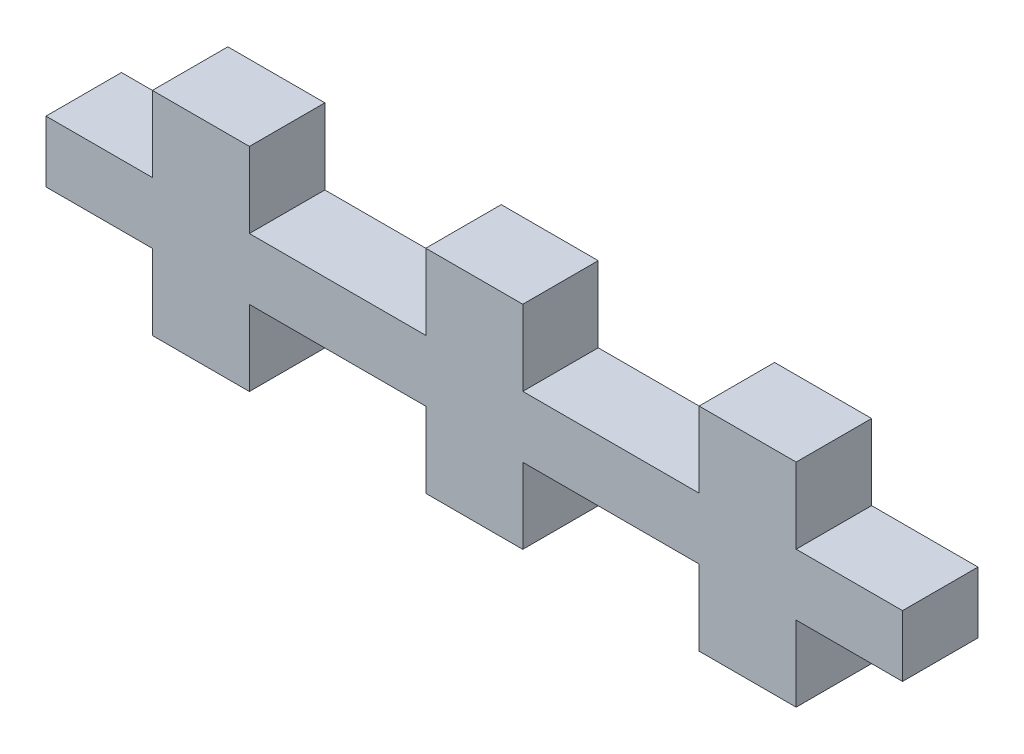
ISO-10303-21;
HEADER;
FILE_DESCRIPTION(('STEP AP214'),'2;1');
FILE_NAME('part.step','',(''),(''),'','','');
FILE_SCHEMA(('AUTOMOTIVE_DESIGN { 1 0 10303 214 1 1 1 1 }'));
ENDSEC;
DATA;
#1=APPLICATION_CONTEXT('core data for automotive mechanical design processes');
#2=APPLICATION_PROTOCOL_DEFINITION('international standard','automotive_design',2000,#1);
#3=PRODUCT_CONTEXT('',#1,'mechanical');
#4=PRODUCT('Part','Part','',(#3));
#5=PRODUCT_RELATED_PRODUCT_CATEGORY('part','',(#4));
#6=PRODUCT_DEFINITION_FORMATION('','',#4);
#7=PRODUCT_DEFINITION_CONTEXT('part definition',#1,'design');
#8=PRODUCT_DEFINITION('design','',#6,#7);
#9=PRODUCT_DEFINITION_SHAPE('','',#8);
#10=(LENGTH_UNIT() NAMED_UNIT(*) SI_UNIT(.MILLI.,.METRE.));
#11=(NAMED_UNIT(*) PLANE_ANGLE_UNIT() SI_UNIT($,.RADIAN.));
#12=(NAMED_UNIT(*) SI_UNIT($,.STERADIAN.) SOLID_ANGLE_UNIT());
#13=UNCERTAINTY_MEASURE_WITH_UNIT(LENGTH_MEASURE(1.E-05),#10,'distance_accuracy_value','');
#14=(GEOMETRIC_REPRESENTATION_CONTEXT(3) GLOBAL_UNCERTAINTY_ASSIGNED_CONTEXT((#13)) GLOBAL_UNIT_ASSIGNED_CONTEXT((#10,
#11,#12)) REPRESENTATION_CONTEXT('',''));
#15=CARTESIAN_POINT('',(0.,0.,0.));
#16=DIRECTION('',(0.,0.,1.));
#17=DIRECTION('',(1.,0.,0.));
#18=AXIS2_PLACEMENT_3D('',#15,#16,#17);
#19=CARTESIAN_POINT('',(-13.54064,5.71563999999998,0.));
#20=DIRECTION('',(-1.,0.,0.));
#21=DIRECTION('',(0.,0.,1.));
#22=AXIS2_PLACEMENT_3D('',#19,#20,#21);
#23=PLANE('',#22);
#24=DIRECTION('',(0.,-1.,0.));
#25=VECTOR('',#24,1.);
#26=CARTESIAN_POINT('',(-13.54064,5.71563999999998,3.175));
#27=LINE('',#26,#25);
#28=CARTESIAN_POINT('',(-13.54064,5.71563999999998,3.175));
#29=VERTEX_POINT('',#28);
#30=CARTESIAN_POINT('',(-13.54064,2.54064,3.175));
#31=VERTEX_POINT('',#30);
#32=EDGE_CURVE('E268',#29,#31,#27,.T.);
#33=ORIENTED_EDGE('',*,*,#32,.F.);
#34=DIRECTION('',(0.,0.,1.));
#35=VECTOR('',#34,1.);
#36=CARTESIAN_POINT('',(-13.54064,5.71563999999998,0.));
#37=LINE('',#36,#35);
#38=CARTESIAN_POINT('',(-13.54064,5.71563999999998,0.));
#39=VERTEX_POINT('',#38);
#40=EDGE_CURVE('E11',#39,#29,#37,.T.);
#41=ORIENTED_EDGE('',*,*,#40,.F.);
#42=DIRECTION('',(0.,-1.,0.));
#43=VECTOR('',#42,1.);
#44=CARTESIAN_POINT('',(-13.54064,5.71563999999998,0.));
#45=LINE('',#44,#43);
#46=CARTESIAN_POINT('',(-13.54064,2.54064,0.));
#47=VERTEX_POINT('',#46);
#48=EDGE_CURVE('E376',#39,#47,#45,.T.);
#49=ORIENTED_EDGE('',*,*,#48,.T.);
#50=DIRECTION('',(0.,0.,1.));
#51=VECTOR('',#50,1.);
#52=CARTESIAN_POINT('',(-13.54064,2.54064,0.));
#53=LINE('',#52,#51);
#54=EDGE_CURVE('E49',#47,#31,#53,.T.);
#55=ORIENTED_EDGE('',*,*,#54,.T.);
#56=EDGE_LOOP('',(#33,#41,#49,#55));
#57=FACE_BOUND('',#56,.T.);
#58=ADVANCED_FACE('F45',(#57),#23,.T.);
#59=CARTESIAN_POINT('',(-9.45935999999999,5.71563999999998,0.));
#60=DIRECTION('',(0.,1.,0.));
#61=DIRECTION('',(-1.,0.,0.));
#62=AXIS2_PLACEMENT_3D('',#59,#60,#61);
#63=PLANE('',#62);
#64=DIRECTION('',(-1.,0.,0.));
#65=VECTOR('',#64,1.);
#66=CARTESIAN_POINT('',(-9.45935999999999,5.71563999999998,3.175));
#67=LINE('',#66,#65);
#68=CARTESIAN_POINT('',(-9.45935999999999,5.71563999999998,3.175));
#69=VERTEX_POINT('',#68);
#70=EDGE_CURVE('E373',#69,#29,#67,.T.);
#71=ORIENTED_EDGE('',*,*,#70,.F.);
#72=DIRECTION('',(0.,0.,1.));
#73=VECTOR('',#72,1.);
#74=CARTESIAN_POINT('',(-9.45935999999999,5.71563999999998,0.));
#75=LINE('',#74,#73);
#76=CARTESIAN_POINT('',(-9.45935999999999,5.71563999999998,0.));
#77=VERTEX_POINT('',#76);
#78=EDGE_CURVE('E56',#77,#69,#75,.T.);
#79=ORIENTED_EDGE('',*,*,#78,.F.);
#80=DIRECTION('',(-1.,0.,0.));
#81=VECTOR('',#80,1.);
#82=CARTESIAN_POINT('',(-9.45935999999999,5.71563999999998,0.));
#83=LINE('',#82,#81);
#84=EDGE_CURVE('E254',#77,#39,#83,.T.);
#85=ORIENTED_EDGE('',*,*,#84,.T.);
#86=ORIENTED_EDGE('',*,*,#40,.T.);
#87=EDGE_LOOP('',(#71,#79,#85,#86));
#88=FACE_BOUND('',#87,.T.);
#89=ADVANCED_FACE('F454',(#88),#63,.T.);
#90=CARTESIAN_POINT('',(-9.45935999999999,2.54064,0.));
#91=DIRECTION('',(1.,0.,0.));
#92=DIRECTION('',(0.,0.,-1.));
#93=AXIS2_PLACEMENT_3D('',#90,#91,#92);
#94=PLANE('',#93);
#95=DIRECTION('',(0.,1.,0.));
#96=VECTOR('',#95,1.);
#97=CARTESIAN_POINT('',(-9.45935999999999,2.54064,3.175));
#98=LINE('',#97,#96);
#99=CARTESIAN_POINT('',(-9.45935999999999,2.54064,3.175));
#100=VERTEX_POINT('',#99);
#101=EDGE_CURVE('E241',#100,#69,#98,.T.);
#102=ORIENTED_EDGE('',*,*,#101,.F.);
#103=DIRECTION('',(0.,0.,1.));
#104=VECTOR('',#103,1.);
#105=CARTESIAN_POINT('',(-9.45935999999999,2.54064,0.));
#106=LINE('',#105,#104);
#107=CARTESIAN_POINT('',(-9.45935999999999,2.54064,0.));
#108=VERTEX_POINT('',#107);
#109=EDGE_CURVE('E236',#108,#100,#106,.T.);
#110=ORIENTED_EDGE('',*,*,#109,.F.);
#111=DIRECTION('',(0.,1.,0.));
#112=VECTOR('',#111,1.);
#113=CARTESIAN_POINT('',(-9.45935999999999,2.54064,0.));
#114=LINE('',#113,#112);
#115=EDGE_CURVE('E239',#108,#77,#114,.T.);
#116=ORIENTED_EDGE('',*,*,#115,.T.);
#117=ORIENTED_EDGE('',*,*,#78,.T.);
#118=EDGE_LOOP('',(#102,#110,#116,#117));
#119=FACE_BOUND('',#118,.T.);
#120=ADVANCED_FACE('F238',(#119),#94,.T.);
#121=CARTESIAN_POINT('',(-2.04064000000001,2.54064,0.));
#122=DIRECTION('',(0.,1.,0.));
#123=DIRECTION('',(-1.,0.,0.));
#124=AXIS2_PLACEMENT_3D('',#121,#122,#123);
#125=PLANE('',#124);
#126=DIRECTION('',(-1.,0.,0.));
#127=VECTOR('',#126,1.);
#128=CARTESIAN_POINT('',(-2.04064000000001,2.54064,3.175));
#129=LINE('',#128,#127);
#130=CARTESIAN_POINT('',(-2.04064000000001,2.54064,3.175));
#131=VERTEX_POINT('',#130);
#132=EDGE_CURVE('E368',#131,#100,#129,.T.);
#133=ORIENTED_EDGE('',*,*,#132,.F.);
#134=DIRECTION('',(0.,0.,1.));
#135=VECTOR('',#134,1.);
#136=CARTESIAN_POINT('',(-2.04064000000001,2.54064,0.));
#137=LINE('',#136,#135);
#138=CARTESIAN_POINT('',(-2.04064000000001,2.54064,0.));
#139=VERTEX_POINT('',#138);
#140=EDGE_CURVE('E247',#139,#131,#137,.T.);
#141=ORIENTED_EDGE('',*,*,#140,.F.);
#142=DIRECTION('',(-1.,0.,0.));
#143=VECTOR('',#142,1.);
#144=CARTESIAN_POINT('',(-2.04064000000001,2.54064,0.));
#145=LINE('',#144,#143);
#146=EDGE_CURVE('E252',#139,#108,#145,.T.);
#147=ORIENTED_EDGE('',*,*,#146,.T.);
#148=ORIENTED_EDGE('',*,*,#109,.T.);
#149=EDGE_LOOP('',(#133,#141,#147,#148));
#150=FACE_BOUND('',#149,.T.);
#151=ADVANCED_FACE('F257',(#150),#125,.T.);
#152=CARTESIAN_POINT('',(-2.04064000000001,5.71563999999999,0.));
#153=DIRECTION('',(-1.,0.,0.));
#154=DIRECTION('',(0.,-1.,0.));
#155=AXIS2_PLACEMENT_3D('',#152,#153,#154);
#156=PLANE('',#155);
#157=DIRECTION('',(0.,-1.,0.));
#158=VECTOR('',#157,1.);
#159=CARTESIAN_POINT('',(-2.04064000000001,5.71563999999999,3.175));
#160=LINE('',#159,#158);
#161=CARTESIAN_POINT('',(-2.04064000000001,5.71563999999999,3.175));
#162=VERTEX_POINT('',#161);
#163=EDGE_CURVE('E364',#162,#131,#160,.T.);
#164=ORIENTED_EDGE('',*,*,#163,.F.);
#165=DIRECTION('',(0.,0.,1.));
#166=VECTOR('',#165,1.);
#167=CARTESIAN_POINT('',(-2.04064000000001,5.71563999999999,0.));
#168=LINE('',#167,#166);
#169=CARTESIAN_POINT('',(-2.04064000000001,5.71563999999999,0.));
#170=VERTEX_POINT('',#169);
#171=EDGE_CURVE('E382',#170,#162,#168,.T.);
#172=ORIENTED_EDGE('',*,*,#171,.F.);
#173=DIRECTION('',(0.,-1.,0.));
#174=VECTOR('',#173,1.);
#175=CARTESIAN_POINT('',(-2.04064000000001,5.71563999999999,0.));
#176=LINE('',#175,#174);
#177=EDGE_CURVE('E259',#170,#139,#176,.T.);
#178=ORIENTED_EDGE('',*,*,#177,.T.);
#179=ORIENTED_EDGE('',*,*,#140,.T.);
#180=EDGE_LOOP('',(#164,#172,#178,#179));
#181=FACE_BOUND('',#180,.T.);
#182=ADVANCED_FACE('F466',(#181),#156,.T.);
#183=CARTESIAN_POINT('',(2.04064000000001,5.71563999999999,0.));
#184=DIRECTION('',(0.,1.,0.));
#185=DIRECTION('',(0.,0.,1.));
#186=AXIS2_PLACEMENT_3D('',#183,#184,#185);
#187=PLANE('',#186);
#188=DIRECTION('',(-1.,0.,0.));
#189=VECTOR('',#188,1.);
#190=CARTESIAN_POINT('',(2.04064000000001,5.71563999999999,3.175));
#191=LINE('',#190,#189);
#192=CARTESIAN_POINT('',(2.04064000000001,5.71563999999999,3.175));
#193=VERTEX_POINT('',#192);
#194=EDGE_CURVE('E360',#193,#162,#191,.T.);
#195=ORIENTED_EDGE('',*,*,#194,.F.);
#196=DIRECTION('',(0.,0.,1.));
#197=VECTOR('',#196,1.);
#198=CARTESIAN_POINT('',(2.04064000000001,5.71563999999999,0.));
#199=LINE('',#198,#197);
#200=CARTESIAN_POINT('',(2.04064000000001,5.71563999999999,0.));
#201=VERTEX_POINT('',#200);
#202=EDGE_CURVE('E385',#201,#193,#199,.T.);
#203=ORIENTED_EDGE('',*,*,#202,.F.);
#204=DIRECTION('',(-1.,0.,0.));
#205=VECTOR('',#204,1.);
#206=CARTESIAN_POINT('',(2.04064000000001,5.71563999999999,0.));
#207=LINE('',#206,#205);
#208=EDGE_CURVE('E262',#201,#170,#207,.T.);
#209=ORIENTED_EDGE('',*,*,#208,.T.);
#210=ORIENTED_EDGE('',*,*,#171,.T.);
#211=EDGE_LOOP('',(#195,#203,#209,#210));
#212=FACE_BOUND('',#211,.T.);
#213=ADVANCED_FACE('F469',(#212),#187,.T.);
#214=CARTESIAN_POINT('',(2.04064000000001,2.54064,0.));
#215=DIRECTION('',(1.,0.,0.));
#216=DIRECTION('',(0.,1.,0.));
#217=AXIS2_PLACEMENT_3D('',#214,#215,#216);
#218=PLANE('',#217);
#219=DIRECTION('',(0.,1.,0.));
#220=VECTOR('',#219,1.);
#221=CARTESIAN_POINT('',(2.04064000000001,2.54064,3.175));
#222=LINE('',#221,#220);
#223=CARTESIAN_POINT('',(2.04064000000001,2.54064,3.175));
#224=VERTEX_POINT('',#223);
#225=EDGE_CURVE('E356',#224,#193,#222,.T.);
#226=ORIENTED_EDGE('',*,*,#225,.F.);
#227=DIRECTION('',(0.,0.,1.));
#228=VECTOR('',#227,1.);
#229=CARTESIAN_POINT('',(2.04064000000001,2.54064,0.));
#230=LINE('',#229,#228);
#231=CARTESIAN_POINT('',(2.04064000000001,2.54064,0.));
#232=VERTEX_POINT('',#231);
#233=EDGE_CURVE('E388',#232,#224,#230,.T.);
#234=ORIENTED_EDGE('',*,*,#233,.F.);
#235=DIRECTION('',(0.,1.,0.));
#236=VECTOR('',#235,1.);
#237=CARTESIAN_POINT('',(2.04064000000001,2.54064,0.));
#238=LINE('',#237,#236);
#239=EDGE_CURVE('E861',#232,#201,#238,.T.);
#240=ORIENTED_EDGE('',*,*,#239,.T.);
#241=ORIENTED_EDGE('',*,*,#202,.T.);
#242=EDGE_LOOP('',(#226,#234,#240,#241));
#243=FACE_BOUND('',#242,.T.);
#244=ADVANCED_FACE('F473',(#243),#218,.T.);
#245=CARTESIAN_POINT('',(9.45936000000006,2.54064,0.));
#246=DIRECTION('',(0.,1.,0.));
#247=DIRECTION('',(-1.,0.,0.));
#248=AXIS2_PLACEMENT_3D('',#245,#246,#247);
#249=PLANE('',#248);
#250=DIRECTION('',(-1.,0.,0.));
#251=VECTOR('',#250,1.);
#252=CARTESIAN_POINT('',(9.45936000000006,2.54064,3.175));
#253=LINE('',#252,#251);
#254=CARTESIAN_POINT('',(9.45936000000006,2.54064,3.175));
#255=VERTEX_POINT('',#254);
#256=EDGE_CURVE('E352',#255,#224,#253,.T.);
#257=ORIENTED_EDGE('',*,*,#256,.F.);
#258=DIRECTION('',(0.,0.,1.));
#259=VECTOR('',#258,1.);
#260=CARTESIAN_POINT('',(9.45936000000006,2.54064,0.));
#261=LINE('',#260,#259);
#262=CARTESIAN_POINT('',(9.45936000000006,2.54064,0.));
#263=VERTEX_POINT('',#262);
#264=EDGE_CURVE('E391',#263,#255,#261,.T.);
#265=ORIENTED_EDGE('',*,*,#264,.F.);
#266=DIRECTION('',(-1.,0.,0.));
#267=VECTOR('',#266,1.);
#268=CARTESIAN_POINT('',(9.45936000000006,2.54064,0.));
#269=LINE('',#268,#267);
#270=EDGE_CURVE('E857',#263,#232,#269,.T.);
#271=ORIENTED_EDGE('',*,*,#270,.T.);
#272=ORIENTED_EDGE('',*,*,#233,.T.);
#273=EDGE_LOOP('',(#257,#265,#271,#272));
#274=FACE_BOUND('',#273,.T.);
#275=ADVANCED_FACE('F477',(#274),#249,.T.);
#276=CARTESIAN_POINT('',(9.45936000000006,5.71563999999997,0.));
#277=DIRECTION('',(-1.,0.,0.));
#278=DIRECTION('',(0.,0.,1.));
#279=AXIS2_PLACEMENT_3D('',#276,#277,#278);
#280=PLANE('',#279);
#281=DIRECTION('',(0.,-1.,0.));
#282=VECTOR('',#281,1.);
#283=CARTESIAN_POINT('',(9.45936000000006,5.71563999999997,3.175));
#284=LINE('',#283,#282);
#285=CARTESIAN_POINT('',(9.45936000000006,5.71563999999997,3.175));
#286=VERTEX_POINT('',#285);
#287=EDGE_CURVE('E348',#286,#255,#284,.T.);
#288=ORIENTED_EDGE('',*,*,#287,.F.);
#289=DIRECTION('',(0.,0.,1.));
#290=VECTOR('',#289,1.);
#291=CARTESIAN_POINT('',(9.45936000000006,5.71563999999997,0.));
#292=LINE('',#291,#290);
#293=CARTESIAN_POINT('',(9.45936000000006,5.71563999999997,0.));
#294=VERTEX_POINT('',#293);
#295=EDGE_CURVE('E394',#294,#286,#292,.T.);
#296=ORIENTED_EDGE('',*,*,#295,.F.);
#297=DIRECTION('',(0.,-1.,0.));
#298=VECTOR('',#297,1.);
#299=CARTESIAN_POINT('',(9.45936000000006,5.71563999999997,0.));
#300=LINE('',#299,#298);
#301=EDGE_CURVE('E871',#294,#263,#300,.T.);
#302=ORIENTED_EDGE('',*,*,#301,.T.);
#303=ORIENTED_EDGE('',*,*,#264,.T.);
#304=EDGE_LOOP('',(#288,#296,#302,#303));
#305=FACE_BOUND('',#304,.T.);
#306=ADVANCED_FACE('F481',(#305),#280,.T.);
#307=CARTESIAN_POINT('',(13.5406400000001,5.71563999999997,0.));
#308=DIRECTION('',(0.,1.,0.));
#309=DIRECTION('',(-1.,0.,0.));
#310=AXIS2_PLACEMENT_3D('',#307,#308,#309);
#311=PLANE('',#310);
#312=DIRECTION('',(-1.,0.,0.));
#313=VECTOR('',#312,1.);
#314=CARTESIAN_POINT('',(13.5406400000001,5.71563999999997,3.175));
#315=LINE('',#314,#313);
#316=CARTESIAN_POINT('',(13.5406400000001,5.71563999999997,3.175));
#317=VERTEX_POINT('',#316);
#318=EDGE_CURVE('E344',#317,#286,#315,.T.);
#319=ORIENTED_EDGE('',*,*,#318,.F.);
#320=DIRECTION('',(0.,0.,1.));
#321=VECTOR('',#320,1.);
#322=CARTESIAN_POINT('',(13.5406400000001,5.71563999999997,0.));
#323=LINE('',#322,#321);
#324=CARTESIAN_POINT('',(13.5406400000001,5.71563999999997,0.));
#325=VERTEX_POINT('',#324);
#326=EDGE_CURVE('E397',#325,#317,#323,.T.);
#327=ORIENTED_EDGE('',*,*,#326,.F.);
#328=DIRECTION('',(-1.,0.,0.));
#329=VECTOR('',#328,1.);
#330=CARTESIAN_POINT('',(13.5406400000001,5.71563999999997,0.));
#331=LINE('',#330,#329);
#332=EDGE_CURVE('E850',#325,#294,#331,.T.);
#333=ORIENTED_EDGE('',*,*,#332,.T.);
#334=ORIENTED_EDGE('',*,*,#295,.T.);
#335=EDGE_LOOP('',(#319,#327,#333,#334));
#336=FACE_BOUND('',#335,.T.);
#337=ADVANCED_FACE('F485',(#336),#311,.T.);
#338=CARTESIAN_POINT('',(13.5406400000001,2.54064000000001,0.));
#339=DIRECTION('',(1.,0.,0.));
#340=DIRECTION('',(0.,0.,-1.));
#341=AXIS2_PLACEMENT_3D('',#338,#339,#340);
#342=PLANE('',#341);
#343=DIRECTION('',(0.,1.,0.));
#344=VECTOR('',#343,1.);
#345=CARTESIAN_POINT('',(13.5406400000001,2.54064000000001,3.175));
#346=LINE('',#345,#344);
#347=CARTESIAN_POINT('',(13.5406400000001,2.54064000000001,3.175));
#348=VERTEX_POINT('',#347);
#349=EDGE_CURVE('E340',#348,#317,#346,.T.);
#350=ORIENTED_EDGE('',*,*,#349,.F.);
#351=DIRECTION('',(0.,0.,1.));
#352=VECTOR('',#351,1.);
#353=CARTESIAN_POINT('',(13.5406400000001,2.54064000000001,0.));
#354=LINE('',#353,#352);
#355=CARTESIAN_POINT('',(13.5406400000001,2.54064000000001,0.));
#356=VERTEX_POINT('',#355);
#357=EDGE_CURVE('E400',#356,#348,#354,.T.);
#358=ORIENTED_EDGE('',*,*,#357,.F.);
#359=DIRECTION('',(0.,1.,0.));
#360=VECTOR('',#359,1.);
#361=CARTESIAN_POINT('',(13.5406400000001,2.54064000000001,0.));
#362=LINE('',#361,#360);
#363=EDGE_CURVE('E846',#356,#325,#362,.T.);
#364=ORIENTED_EDGE('',*,*,#363,.T.);
#365=ORIENTED_EDGE('',*,*,#326,.T.);
#366=EDGE_LOOP('',(#350,#358,#364,#365));
#367=FACE_BOUND('',#366,.T.);
#368=ADVANCED_FACE('F489',(#367),#342,.T.);
#369=CARTESIAN_POINT('',(18.01564,2.54064,0.));
#370=DIRECTION('',(0.,1.,0.));
#371=DIRECTION('',(-1.,0.,0.));
#372=AXIS2_PLACEMENT_3D('',#369,#370,#371);
#373=PLANE('',#372);
#374=DIRECTION('',(-1.,0.,0.));
#375=VECTOR('',#374,1.);
#376=CARTESIAN_POINT('',(18.01564,2.54064,3.175));
#377=LINE('',#376,#375);
#378=CARTESIAN_POINT('',(18.01564,2.54064,3.175));
#379=VERTEX_POINT('',#378);
#380=EDGE_CURVE('E336',#379,#348,#377,.T.);
#381=ORIENTED_EDGE('',*,*,#380,.F.);
#382=DIRECTION('',(0.,0.,1.));
#383=VECTOR('',#382,1.);
#384=CARTESIAN_POINT('',(18.01564,2.54064,0.));
#385=LINE('',#384,#383);
#386=CARTESIAN_POINT('',(18.01564,2.54064,0.));
#387=VERTEX_POINT('',#386);
#388=EDGE_CURVE('E403',#387,#379,#385,.T.);
#389=ORIENTED_EDGE('',*,*,#388,.F.);
#390=DIRECTION('',(-1.,0.,0.));
#391=VECTOR('',#390,1.);
#392=CARTESIAN_POINT('',(18.01564,2.54064,0.));
#393=LINE('',#392,#391);
#394=EDGE_CURVE('E878',#387,#356,#393,.T.);
#395=ORIENTED_EDGE('',*,*,#394,.T.);
#396=ORIENTED_EDGE('',*,*,#357,.T.);
#397=EDGE_LOOP('',(#381,#389,#395,#396));
#398=FACE_BOUND('',#397,.T.);
#399=ADVANCED_FACE('F493',(#398),#373,.T.);
#400=CARTESIAN_POINT('',(18.01564,-0.04064,0.));
#401=DIRECTION('',(1.,0.,0.));
#402=DIRECTION('',(0.,0.,-1.));
#403=AXIS2_PLACEMENT_3D('',#400,#401,#402);
#404=PLANE('',#403);
#405=DIRECTION('',(0.,1.,0.));
#406=VECTOR('',#405,1.);
#407=CARTESIAN_POINT('',(18.01564,-0.04064,3.175));
#408=LINE('',#407,#406);
#409=CARTESIAN_POINT('',(18.01564,-0.04064,3.175));
#410=VERTEX_POINT('',#409);
#411=EDGE_CURVE('E332',#410,#379,#408,.T.);
#412=ORIENTED_EDGE('',*,*,#411,.F.);
#413=DIRECTION('',(0.,0.,1.));
#414=VECTOR('',#413,1.);
#415=CARTESIAN_POINT('',(18.01564,-0.04064,0.));
#416=LINE('',#415,#414);
#417=CARTESIAN_POINT('',(18.01564,-0.04064,0.));
#418=VERTEX_POINT('',#417);
#419=EDGE_CURVE('E406',#418,#410,#416,.T.);
#420=ORIENTED_EDGE('',*,*,#419,.F.);
#421=DIRECTION('',(0.,1.,0.));
#422=VECTOR('',#421,1.);
#423=CARTESIAN_POINT('',(18.01564,-0.04064,0.));
#424=LINE('',#423,#422);
#425=EDGE_CURVE('E839',#418,#387,#424,.T.);
#426=ORIENTED_EDGE('',*,*,#425,.T.);
#427=ORIENTED_EDGE('',*,*,#388,.T.);
#428=EDGE_LOOP('',(#412,#420,#426,#427));
#429=FACE_BOUND('',#428,.T.);
#430=ADVANCED_FACE('F497',(#429),#404,.T.);
#431=CARTESIAN_POINT('',(13.5406400000001,-0.04064,0.));
#432=DIRECTION('',(0.,-1.,0.));
#433=DIRECTION('',(0.,0.,-1.));
#434=AXIS2_PLACEMENT_3D('',#431,#432,#433);
#435=PLANE('',#434);
#436=DIRECTION('',(1.,0.,0.));
#437=VECTOR('',#436,1.);
#438=CARTESIAN_POINT('',(13.5406400000001,-0.04064,3.175));
#439=LINE('',#438,#437);
#440=CARTESIAN_POINT('',(13.5406400000001,-0.04064,3.175));
#441=VERTEX_POINT('',#440);
#442=EDGE_CURVE('E328',#441,#410,#439,.T.);
#443=ORIENTED_EDGE('',*,*,#442,.F.);
#444=DIRECTION('',(0.,0.,1.));
#445=VECTOR('',#444,1.);
#446=CARTESIAN_POINT('',(13.5406400000001,-0.04064,0.));
#447=LINE('',#446,#445);
#448=CARTESIAN_POINT('',(13.5406400000001,-0.04064,0.));
#449=VERTEX_POINT('',#448);
#450=EDGE_CURVE('E409',#449,#441,#447,.T.);
#451=ORIENTED_EDGE('',*,*,#450,.F.);
#452=DIRECTION('',(1.,0.,0.));
#453=VECTOR('',#452,1.);
#454=CARTESIAN_POINT('',(13.5406400000001,-0.04064,0.));
#455=LINE('',#454,#453);
#456=EDGE_CURVE('E835',#449,#418,#455,.T.);
#457=ORIENTED_EDGE('',*,*,#456,.T.);
#458=ORIENTED_EDGE('',*,*,#419,.T.);
#459=EDGE_LOOP('',(#443,#451,#457,#458));
#460=FACE_BOUND('',#459,.T.);
#461=ADVANCED_FACE('F501',(#460),#435,.T.);
#462=CARTESIAN_POINT('',(13.5406400000001,-3.21563999999999,0.));
#463=DIRECTION('',(1.,0.,0.));
#464=DIRECTION('',(0.,0.,-1.));
#465=AXIS2_PLACEMENT_3D('',#462,#463,#464);
#466=PLANE('',#465);
#467=DIRECTION('',(0.,1.,0.));
#468=VECTOR('',#467,1.);
#469=CARTESIAN_POINT('',(13.5406400000001,-3.21563999999999,3.175));
#470=LINE('',#469,#468);
#471=CARTESIAN_POINT('',(13.5406400000001,-3.21563999999999,3.175));
#472=VERTEX_POINT('',#471);
#473=EDGE_CURVE('E324',#472,#441,#470,.T.);
#474=ORIENTED_EDGE('',*,*,#473,.F.);
#475=DIRECTION('',(0.,0.,1.));
#476=VECTOR('',#475,1.);
#477=CARTESIAN_POINT('',(13.5406400000001,-3.21563999999999,0.));
#478=LINE('',#477,#476);
#479=CARTESIAN_POINT('',(13.5406400000001,-3.21563999999999,0.));
#480=VERTEX_POINT('',#479);
#481=EDGE_CURVE('E412',#480,#472,#478,.T.);
#482=ORIENTED_EDGE('',*,*,#481,.F.);
#483=DIRECTION('',(0.,1.,0.));
#484=VECTOR('',#483,1.);
#485=CARTESIAN_POINT('',(13.5406400000001,-3.21563999999999,0.));
#486=LINE('',#485,#484);
#487=EDGE_CURVE('E885',#480,#449,#486,.T.);
#488=ORIENTED_EDGE('',*,*,#487,.T.);
#489=ORIENTED_EDGE('',*,*,#450,.T.);
#490=EDGE_LOOP('',(#474,#482,#488,#489));
#491=FACE_BOUND('',#490,.T.);
#492=ADVANCED_FACE('F505',(#491),#466,.T.);
#493=CARTESIAN_POINT('',(9.45936000000006,-3.21563999999999,0.));
#494=DIRECTION('',(0.,-1.,0.));
#495=DIRECTION('',(1.,0.,0.));
#496=AXIS2_PLACEMENT_3D('',#493,#494,#495);
#497=PLANE('',#496);
#498=DIRECTION('',(1.,0.,0.));
#499=VECTOR('',#498,1.);
#500=CARTESIAN_POINT('',(9.45936000000006,-3.21563999999999,3.175));
#501=LINE('',#500,#499);
#502=CARTESIAN_POINT('',(9.45936000000006,-3.21563999999999,3.175));
#503=VERTEX_POINT('',#502);
#504=EDGE_CURVE('E320',#503,#472,#501,.T.);
#505=ORIENTED_EDGE('',*,*,#504,.F.);
#506=DIRECTION('',(0.,0.,1.));
#507=VECTOR('',#506,1.);
#508=CARTESIAN_POINT('',(9.45936000000006,-3.21563999999999,0.));
#509=LINE('',#508,#507);
#510=CARTESIAN_POINT('',(9.45936000000006,-3.21563999999999,0.));
#511=VERTEX_POINT('',#510);
#512=EDGE_CURVE('E415',#511,#503,#509,.T.);
#513=ORIENTED_EDGE('',*,*,#512,.F.);
#514=DIRECTION('',(1.,0.,0.));
#515=VECTOR('',#514,1.);
#516=CARTESIAN_POINT('',(9.45936000000006,-3.21563999999999,0.));
#517=LINE('',#516,#515);
#518=EDGE_CURVE('E828',#511,#480,#517,.T.);
#519=ORIENTED_EDGE('',*,*,#518,.T.);
#520=ORIENTED_EDGE('',*,*,#481,.T.);
#521=EDGE_LOOP('',(#505,#513,#519,#520));
#522=FACE_BOUND('',#521,.T.);
#523=ADVANCED_FACE('F509',(#522),#497,.T.);
#524=CARTESIAN_POINT('',(9.45936000000006,-0.04064,0.));
#525=DIRECTION('',(-1.,0.,0.));
#526=DIRECTION('',(0.,0.,1.));
#527=AXIS2_PLACEMENT_3D('',#524,#525,#526);
#528=PLANE('',#527);
#529=DIRECTION('',(0.,-1.,0.));
#530=VECTOR('',#529,1.);
#531=CARTESIAN_POINT('',(9.45936000000006,-0.04064,3.175));
#532=LINE('',#531,#530);
#533=CARTESIAN_POINT('',(9.45936000000006,-0.04064,3.175));
#534=VERTEX_POINT('',#533);
#535=EDGE_CURVE('E316',#534,#503,#532,.T.);
#536=ORIENTED_EDGE('',*,*,#535,.F.);
#537=DIRECTION('',(0.,0.,1.));
#538=VECTOR('',#537,1.);
#539=CARTESIAN_POINT('',(9.45936000000006,-0.04064,0.));
#540=LINE('',#539,#538);
#541=CARTESIAN_POINT('',(9.45936000000006,-0.04064,0.));
#542=VERTEX_POINT('',#541);
#543=EDGE_CURVE('E418',#542,#534,#540,.T.);
#544=ORIENTED_EDGE('',*,*,#543,.F.);
#545=DIRECTION('',(0.,-1.,0.));
#546=VECTOR('',#545,1.);
#547=CARTESIAN_POINT('',(9.45936000000006,-0.04064,0.));
#548=LINE('',#547,#546);
#549=EDGE_CURVE('E824',#542,#511,#548,.T.);
#550=ORIENTED_EDGE('',*,*,#549,.T.);
#551=ORIENTED_EDGE('',*,*,#512,.T.);
#552=EDGE_LOOP('',(#536,#544,#550,#551));
#553=FACE_BOUND('',#552,.T.);
#554=ADVANCED_FACE('F513',(#553),#528,.T.);
#555=CARTESIAN_POINT('',(2.04064000000001,-0.04064,0.));
#556=DIRECTION('',(0.,-1.,0.));
#557=DIRECTION('',(0.,0.,-1.));
#558=AXIS2_PLACEMENT_3D('',#555,#556,#557);
#559=PLANE('',#558);
#560=DIRECTION('',(1.,0.,0.));
#561=VECTOR('',#560,1.);
#562=CARTESIAN_POINT('',(2.04064000000001,-0.04064,3.175));
#563=LINE('',#562,#561);
#564=CARTESIAN_POINT('',(2.04064000000001,-0.04064,3.175));
#565=VERTEX_POINT('',#564);
#566=EDGE_CURVE('E312',#565,#534,#563,.T.);
#567=ORIENTED_EDGE('',*,*,#566,.F.);
#568=DIRECTION('',(0.,0.,1.));
#569=VECTOR('',#568,1.);
#570=CARTESIAN_POINT('',(2.04064000000001,-0.04064,0.));
#571=LINE('',#570,#569);
#572=CARTESIAN_POINT('',(2.04064000000001,-0.04064,0.));
#573=VERTEX_POINT('',#572);
#574=EDGE_CURVE('E421',#573,#565,#571,.T.);
#575=ORIENTED_EDGE('',*,*,#574,.F.);
#576=DIRECTION('',(1.,0.,0.));
#577=VECTOR('',#576,1.);
#578=CARTESIAN_POINT('',(2.04064000000001,-0.04064,0.));
#579=LINE('',#578,#577);
#580=EDGE_CURVE('E892',#573,#542,#579,.T.);
#581=ORIENTED_EDGE('',*,*,#580,.T.);
#582=ORIENTED_EDGE('',*,*,#543,.T.);
#583=EDGE_LOOP('',(#567,#575,#581,#582));
#584=FACE_BOUND('',#583,.T.);
#585=ADVANCED_FACE('F517',(#584),#559,.T.);
#586=CARTESIAN_POINT('',(2.04064,-3.21563999999999,0.));
#587=DIRECTION('',(1.,0.,0.));
#588=DIRECTION('',(0.,1.,0.));
#589=AXIS2_PLACEMENT_3D('',#586,#587,#588);
#590=PLANE('',#589);
#591=DIRECTION('',(0.,1.,0.));
#592=VECTOR('',#591,1.);
#593=CARTESIAN_POINT('',(2.04064,-3.21563999999999,3.175));
#594=LINE('',#593,#592);
#595=CARTESIAN_POINT('',(2.04064,-3.21563999999999,3.175));
#596=VERTEX_POINT('',#595);
#597=EDGE_CURVE('E308',#596,#565,#594,.T.);
#598=ORIENTED_EDGE('',*,*,#597,.F.);
#599=DIRECTION('',(0.,0.,1.));
#600=VECTOR('',#599,1.);
#601=CARTESIAN_POINT('',(2.04064,-3.21563999999999,0.));
#602=LINE('',#601,#600);
#603=CARTESIAN_POINT('',(2.04064,-3.21563999999999,0.));
#604=VERTEX_POINT('',#603);
#605=EDGE_CURVE('E424',#604,#596,#602,.T.);
#606=ORIENTED_EDGE('',*,*,#605,.F.);
#607=DIRECTION('',(0.,1.,0.));
#608=VECTOR('',#607,1.);
#609=CARTESIAN_POINT('',(2.04064,-3.21563999999999,0.));
#610=LINE('',#609,#608);
#611=EDGE_CURVE('E817',#604,#573,#610,.T.);
#612=ORIENTED_EDGE('',*,*,#611,.T.);
#613=ORIENTED_EDGE('',*,*,#574,.T.);
#614=EDGE_LOOP('',(#598,#606,#612,#613));
#615=FACE_BOUND('',#614,.T.);
#616=ADVANCED_FACE('F521',(#615),#590,.T.);
#617=CARTESIAN_POINT('',(-2.04063999999999,-3.21564,0.));
#618=DIRECTION('',(0.,-1.,0.));
#619=DIRECTION('',(1.,0.,0.));
#620=AXIS2_PLACEMENT_3D('',#617,#618,#619);
#621=PLANE('',#620);
#622=DIRECTION('',(1.,0.,0.));
#623=VECTOR('',#622,1.);
#624=CARTESIAN_POINT('',(-2.04063999999999,-3.21564,3.175));
#625=LINE('',#624,#623);
#626=CARTESIAN_POINT('',(-2.04063999999999,-3.21564,3.175));
#627=VERTEX_POINT('',#626);
#628=EDGE_CURVE('E304',#627,#596,#625,.T.);
#629=ORIENTED_EDGE('',*,*,#628,.F.);
#630=DIRECTION('',(0.,0.,1.));
#631=VECTOR('',#630,1.);
#632=CARTESIAN_POINT('',(-2.04063999999999,-3.21564,0.));
#633=LINE('',#632,#631);
#634=CARTESIAN_POINT('',(-2.04063999999999,-3.21564,0.));
#635=VERTEX_POINT('',#634);
#636=EDGE_CURVE('E427',#635,#627,#633,.T.);
#637=ORIENTED_EDGE('',*,*,#636,.F.);
#638=DIRECTION('',(1.,0.,0.));
#639=VECTOR('',#638,1.);
#640=CARTESIAN_POINT('',(-2.04063999999999,-3.21564,0.));
#641=LINE('',#640,#639);
#642=EDGE_CURVE('E813',#635,#604,#641,.T.);
#643=ORIENTED_EDGE('',*,*,#642,.T.);
#644=ORIENTED_EDGE('',*,*,#605,.T.);
#645=EDGE_LOOP('',(#629,#637,#643,#644));
#646=FACE_BOUND('',#645,.T.);
#647=ADVANCED_FACE('F525',(#646),#621,.T.);
#648=CARTESIAN_POINT('',(-2.04064,-0.04064,0.));
#649=DIRECTION('',(-1.,0.,0.));
#650=DIRECTION('',(0.,-1.,0.));
#651=AXIS2_PLACEMENT_3D('',#648,#649,#650);
#652=PLANE('',#651);
#653=DIRECTION('',(0.,-1.,0.));
#654=VECTOR('',#653,1.);
#655=CARTESIAN_POINT('',(-2.04064,-0.04064,3.175));
#656=LINE('',#655,#654);
#657=CARTESIAN_POINT('',(-2.04064,-0.04064,3.175));
#658=VERTEX_POINT('',#657);
#659=EDGE_CURVE('E300',#658,#627,#656,.T.);
#660=ORIENTED_EDGE('',*,*,#659,.F.);
#661=DIRECTION('',(0.,0.,1.));
#662=VECTOR('',#661,1.);
#663=CARTESIAN_POINT('',(-2.04064,-0.04064,0.));
#664=LINE('',#663,#662);
#665=CARTESIAN_POINT('',(-2.04064,-0.04064,0.));
#666=VERTEX_POINT('',#665);
#667=EDGE_CURVE('E430',#666,#658,#664,.T.);
#668=ORIENTED_EDGE('',*,*,#667,.F.);
#669=DIRECTION('',(0.,-1.,0.));
#670=VECTOR('',#669,1.);
#671=CARTESIAN_POINT('',(-2.04064,-0.04064,0.));
#672=LINE('',#671,#670);
#673=EDGE_CURVE('E899',#666,#635,#672,.T.);
#674=ORIENTED_EDGE('',*,*,#673,.T.);
#675=ORIENTED_EDGE('',*,*,#636,.T.);
#676=EDGE_LOOP('',(#660,#668,#674,#675));
#677=FACE_BOUND('',#676,.T.);
#678=ADVANCED_FACE('F529',(#677),#652,.T.);
#679=CARTESIAN_POINT('',(-9.45936,-0.04064,0.));
#680=DIRECTION('',(0.,-1.,0.));
#681=DIRECTION('',(0.,0.,-1.));
#682=AXIS2_PLACEMENT_3D('',#679,#680,#681);
#683=PLANE('',#682);
#684=DIRECTION('',(1.,0.,0.));
#685=VECTOR('',#684,1.);
#686=CARTESIAN_POINT('',(-9.45936,-0.04064,3.175));
#687=LINE('',#686,#685);
#688=CARTESIAN_POINT('',(-9.45936,-0.04064,3.175));
#689=VERTEX_POINT('',#688);
#690=EDGE_CURVE('E296',#689,#658,#687,.T.);
#691=ORIENTED_EDGE('',*,*,#690,.F.);
#692=DIRECTION('',(0.,0.,1.));
#693=VECTOR('',#692,1.);
#694=CARTESIAN_POINT('',(-9.45936,-0.04064,0.));
#695=LINE('',#694,#693);
#696=CARTESIAN_POINT('',(-9.45936,-0.04064,0.));
#697=VERTEX_POINT('',#696);
#698=EDGE_CURVE('E433',#697,#689,#695,.T.);
#699=ORIENTED_EDGE('',*,*,#698,.F.);
#700=DIRECTION('',(1.,0.,0.));
#701=VECTOR('',#700,1.);
#702=CARTESIAN_POINT('',(-9.45936,-0.04064,0.));
#703=LINE('',#702,#701);
#704=EDGE_CURVE('E806',#697,#666,#703,.T.);
#705=ORIENTED_EDGE('',*,*,#704,.T.);
#706=ORIENTED_EDGE('',*,*,#667,.T.);
#707=EDGE_LOOP('',(#691,#699,#705,#706));
#708=FACE_BOUND('',#707,.T.);
#709=ADVANCED_FACE('F533',(#708),#683,.T.);
#710=CARTESIAN_POINT('',(-9.45936,-3.21563999999999,0.));
#711=DIRECTION('',(1.,0.,0.));
#712=DIRECTION('',(0.,0.,-1.));
#713=AXIS2_PLACEMENT_3D('',#710,#711,#712);
#714=PLANE('',#713);
#715=DIRECTION('',(0.,1.,0.));
#716=VECTOR('',#715,1.);
#717=CARTESIAN_POINT('',(-9.45936,-3.21563999999999,3.175));
#718=LINE('',#717,#716);
#719=CARTESIAN_POINT('',(-9.45936,-3.21563999999999,3.175));
#720=VERTEX_POINT('',#719);
#721=EDGE_CURVE('E292',#720,#689,#718,.T.);
#722=ORIENTED_EDGE('',*,*,#721,.F.);
#723=DIRECTION('',(0.,0.,1.));
#724=VECTOR('',#723,1.);
#725=CARTESIAN_POINT('',(-9.45936,-3.21563999999999,0.));
#726=LINE('',#725,#724);
#727=CARTESIAN_POINT('',(-9.45936,-3.21563999999999,0.));
#728=VERTEX_POINT('',#727);
#729=EDGE_CURVE('E436',#728,#720,#726,.T.);
#730=ORIENTED_EDGE('',*,*,#729,.F.);
#731=DIRECTION('',(0.,1.,0.));
#732=VECTOR('',#731,1.);
#733=CARTESIAN_POINT('',(-9.45936,-3.21563999999999,0.));
#734=LINE('',#733,#732);
#735=EDGE_CURVE('E802',#728,#697,#734,.T.);
#736=ORIENTED_EDGE('',*,*,#735,.T.);
#737=ORIENTED_EDGE('',*,*,#698,.T.);
#738=EDGE_LOOP('',(#722,#730,#736,#737));
#739=FACE_BOUND('',#738,.T.);
#740=ADVANCED_FACE('F537',(#739),#714,.T.);
#741=CARTESIAN_POINT('',(-13.54064,-3.21563999999999,0.));
#742=DIRECTION('',(0.,-1.,0.));
#743=DIRECTION('',(1.,0.,0.));
#744=AXIS2_PLACEMENT_3D('',#741,#742,#743);
#745=PLANE('',#744);
#746=DIRECTION('',(1.,0.,0.));
#747=VECTOR('',#746,1.);
#748=CARTESIAN_POINT('',(-13.54064,-3.21563999999999,3.175));
#749=LINE('',#748,#747);
#750=CARTESIAN_POINT('',(-13.54064,-3.21563999999999,3.175));
#751=VERTEX_POINT('',#750);
#752=EDGE_CURVE('E288',#751,#720,#749,.T.);
#753=ORIENTED_EDGE('',*,*,#752,.F.);
#754=DIRECTION('',(0.,0.,1.));
#755=VECTOR('',#754,1.);
#756=CARTESIAN_POINT('',(-13.54064,-3.21563999999999,0.));
#757=LINE('',#756,#755);
#758=CARTESIAN_POINT('',(-13.54064,-3.21563999999999,0.));
#759=VERTEX_POINT('',#758);
#760=EDGE_CURVE('E439',#759,#751,#757,.T.);
#761=ORIENTED_EDGE('',*,*,#760,.F.);
#762=DIRECTION('',(1.,0.,0.));
#763=VECTOR('',#762,1.);
#764=CARTESIAN_POINT('',(-13.54064,-3.21563999999999,0.));
#765=LINE('',#764,#763);
#766=EDGE_CURVE('E906',#759,#728,#765,.T.);
#767=ORIENTED_EDGE('',*,*,#766,.T.);
#768=ORIENTED_EDGE('',*,*,#729,.T.);
#769=EDGE_LOOP('',(#753,#761,#767,#768));
#770=FACE_BOUND('',#769,.T.);
#771=ADVANCED_FACE('F541',(#770),#745,.T.);
#772=CARTESIAN_POINT('',(-13.54064,-0.04064,0.));
#773=DIRECTION('',(-1.,0.,0.));
#774=DIRECTION('',(0.,0.,1.));
#775=AXIS2_PLACEMENT_3D('',#772,#773,#774);
#776=PLANE('',#775);
#777=DIRECTION('',(0.,-1.,0.));
#778=VECTOR('',#777,1.);
#779=CARTESIAN_POINT('',(-13.54064,-0.04064,3.175));
#780=LINE('',#779,#778);
#781=CARTESIAN_POINT('',(-13.54064,-0.04064,3.175));
#782=VERTEX_POINT('',#781);
#783=EDGE_CURVE('E284',#782,#751,#780,.T.);
#784=ORIENTED_EDGE('',*,*,#783,.F.);
#785=DIRECTION('',(0.,0.,1.));
#786=VECTOR('',#785,1.);
#787=CARTESIAN_POINT('',(-13.54064,-0.04064,0.));
#788=LINE('',#787,#786);
#789=CARTESIAN_POINT('',(-13.54064,-0.04064,0.));
#790=VERTEX_POINT('',#789);
#791=EDGE_CURVE('E442',#790,#782,#788,.T.);
#792=ORIENTED_EDGE('',*,*,#791,.F.);
#793=DIRECTION('',(0.,-1.,0.));
#794=VECTOR('',#793,1.);
#795=CARTESIAN_POINT('',(-13.54064,-0.04064,0.));
#796=LINE('',#795,#794);
#797=EDGE_CURVE('E795',#790,#759,#796,.T.);
#798=ORIENTED_EDGE('',*,*,#797,.T.);
#799=ORIENTED_EDGE('',*,*,#760,.T.);
#800=EDGE_LOOP('',(#784,#792,#798,#799));
#801=FACE_BOUND('',#800,.T.);
#802=ADVANCED_FACE('F545',(#801),#776,.T.);
#803=CARTESIAN_POINT('',(-18.01564,-0.04064,0.));
#804=DIRECTION('',(0.,-1.,0.));
#805=DIRECTION('',(0.,0.,-1.));
#806=AXIS2_PLACEMENT_3D('',#803,#804,#805);
#807=PLANE('',#806);
#808=DIRECTION('',(1.,0.,0.));
#809=VECTOR('',#808,1.);
#810=CARTESIAN_POINT('',(-18.01564,-0.04064,3.175));
#811=LINE('',#810,#809);
#812=CARTESIAN_POINT('',(-18.01564,-0.04064,3.175));
#813=VERTEX_POINT('',#812);
#814=EDGE_CURVE('E280',#813,#782,#811,.T.);
#815=ORIENTED_EDGE('',*,*,#814,.F.);
#816=DIRECTION('',(0.,0.,1.));
#817=VECTOR('',#816,1.);
#818=CARTESIAN_POINT('',(-18.01564,-0.04064,0.));
#819=LINE('',#818,#817);
#820=CARTESIAN_POINT('',(-18.01564,-0.04064,0.));
#821=VERTEX_POINT('',#820);
#822=EDGE_CURVE('E445',#821,#813,#819,.T.);
#823=ORIENTED_EDGE('',*,*,#822,.F.);
#824=DIRECTION('',(1.,0.,0.));
#825=VECTOR('',#824,1.);
#826=CARTESIAN_POINT('',(-18.01564,-0.04064,0.));
#827=LINE('',#826,#825);
#828=EDGE_CURVE('E791',#821,#790,#827,.T.);
#829=ORIENTED_EDGE('',*,*,#828,.T.);
#830=ORIENTED_EDGE('',*,*,#791,.T.);
#831=EDGE_LOOP('',(#815,#823,#829,#830));
#832=FACE_BOUND('',#831,.T.);
#833=ADVANCED_FACE('F549',(#832),#807,.T.);
#834=CARTESIAN_POINT('',(-18.01564,2.54064,0.));
#835=DIRECTION('',(-1.,0.,0.));
#836=DIRECTION('',(0.,0.,1.));
#837=AXIS2_PLACEMENT_3D('',#834,#835,#836);
#838=PLANE('',#837);
#839=DIRECTION('',(0.,-1.,0.));
#840=VECTOR('',#839,1.);
#841=CARTESIAN_POINT('',(-18.01564,2.54064,3.175));
#842=LINE('',#841,#840);
#843=CARTESIAN_POINT('',(-18.01564,2.54064,3.175));
#844=VERTEX_POINT('',#843);
#845=EDGE_CURVE('E276',#844,#813,#842,.T.);
#846=ORIENTED_EDGE('',*,*,#845,.F.);
#847=DIRECTION('',(0.,0.,1.));
#848=VECTOR('',#847,1.);
#849=CARTESIAN_POINT('',(-18.01564,2.54064,0.));
#850=LINE('',#849,#848);
#851=CARTESIAN_POINT('',(-18.01564,2.54064,0.));
#852=VERTEX_POINT('',#851);
#853=EDGE_CURVE('E447',#852,#844,#850,.T.);
#854=ORIENTED_EDGE('',*,*,#853,.F.);
#855=DIRECTION('',(0.,-1.,0.));
#856=VECTOR('',#855,1.);
#857=CARTESIAN_POINT('',(-18.01564,2.54064,0.));
#858=LINE('',#857,#856);
#859=EDGE_CURVE('E913',#852,#821,#858,.T.);
#860=ORIENTED_EDGE('',*,*,#859,.T.);
#861=ORIENTED_EDGE('',*,*,#822,.T.);
#862=EDGE_LOOP('',(#846,#854,#860,#861));
#863=FACE_BOUND('',#862,.T.);
#864=ADVANCED_FACE('F553',(#863),#838,.T.);
#865=CARTESIAN_POINT('',(-13.54064,2.54064,0.));
#866=DIRECTION('',(0.,1.,0.));
#867=DIRECTION('',(-1.,0.,0.));
#868=AXIS2_PLACEMENT_3D('',#865,#866,#867);
#869=PLANE('',#868);
#870=DIRECTION('',(-1.,0.,0.));
#871=VECTOR('',#870,1.);
#872=CARTESIAN_POINT('',(-13.54064,2.54064,3.175));
#873=LINE('',#872,#871);
#874=EDGE_CURVE('E272',#31,#844,#873,.T.);
#875=ORIENTED_EDGE('',*,*,#874,.F.);
#876=ORIENTED_EDGE('',*,*,#54,.F.);
#877=DIRECTION('',(-1.,0.,0.));
#878=VECTOR('',#877,1.);
#879=CARTESIAN_POINT('',(-13.54064,2.54064,0.));
#880=LINE('',#879,#878);
#881=EDGE_CURVE('E916',#47,#852,#880,.T.);
#882=ORIENTED_EDGE('',*,*,#881,.T.);
#883=ORIENTED_EDGE('',*,*,#853,.T.);
#884=EDGE_LOOP('',(#875,#876,#882,#883));
#885=FACE_BOUND('',#884,.T.);
#886=ADVANCED_FACE('F451',(#885),#869,.T.);
#887=CARTESIAN_POINT('',(0.,0.,3.175));
#888=DIRECTION('',(0.,0.,1.));
#889=DIRECTION('',(1.,0.,0.));
#890=AXIS2_PLACEMENT_3D('',#887,#888,#889);
#891=PLANE('',#890);
#892=ORIENTED_EDGE('',*,*,#32,.T.);
#893=ORIENTED_EDGE('',*,*,#874,.T.);
#894=ORIENTED_EDGE('',*,*,#845,.T.);
#895=ORIENTED_EDGE('',*,*,#814,.T.);
#896=ORIENTED_EDGE('',*,*,#783,.T.);
#897=ORIENTED_EDGE('',*,*,#752,.T.);
#898=ORIENTED_EDGE('',*,*,#721,.T.);
#899=ORIENTED_EDGE('',*,*,#690,.T.);
#900=ORIENTED_EDGE('',*,*,#659,.T.);
#901=ORIENTED_EDGE('',*,*,#628,.T.);
#902=ORIENTED_EDGE('',*,*,#597,.T.);
#903=ORIENTED_EDGE('',*,*,#566,.T.);
#904=ORIENTED_EDGE('',*,*,#535,.T.);
#905=ORIENTED_EDGE('',*,*,#504,.T.);
#906=ORIENTED_EDGE('',*,*,#473,.T.);
#907=ORIENTED_EDGE('',*,*,#442,.T.);
#908=ORIENTED_EDGE('',*,*,#411,.T.);
#909=ORIENTED_EDGE('',*,*,#380,.T.);
#910=ORIENTED_EDGE('',*,*,#349,.T.);
#911=ORIENTED_EDGE('',*,*,#318,.T.);
#912=ORIENTED_EDGE('',*,*,#287,.T.);
#913=ORIENTED_EDGE('',*,*,#256,.T.);
#914=ORIENTED_EDGE('',*,*,#225,.T.);
#915=ORIENTED_EDGE('',*,*,#194,.T.);
#916=ORIENTED_EDGE('',*,*,#163,.T.);
#917=ORIENTED_EDGE('',*,*,#132,.T.);
#918=ORIENTED_EDGE('',*,*,#101,.T.);
#919=ORIENTED_EDGE('',*,*,#70,.T.);
#920=EDGE_LOOP('',(#892,#893,#894,#895,#896,#897,#898,#899,#900,#901,#902,#903,#904,#905,#906,
#907,#908,#909,#910,#911,#912,#913,#914,#915,#916,#917,#918,#919));
#921=FACE_BOUND('',#920,.T.);
#922=ADVANCED_FACE('F453',(#921),#891,.T.);
#923=CARTESIAN_POINT('',(0.,0.,0.));
#924=DIRECTION('',(0.,0.,1.));
#925=DIRECTION('',(1.,0.,0.));
#926=AXIS2_PLACEMENT_3D('',#923,#924,#925);
#927=PLANE('',#926);
#928=ORIENTED_EDGE('',*,*,#48,.F.);
#929=ORIENTED_EDGE('',*,*,#84,.F.);
#930=ORIENTED_EDGE('',*,*,#115,.F.);
#931=ORIENTED_EDGE('',*,*,#146,.F.);
#932=ORIENTED_EDGE('',*,*,#177,.F.);
#933=ORIENTED_EDGE('',*,*,#208,.F.);
#934=ORIENTED_EDGE('',*,*,#239,.F.);
#935=ORIENTED_EDGE('',*,*,#270,.F.);
#936=ORIENTED_EDGE('',*,*,#301,.F.);
#937=ORIENTED_EDGE('',*,*,#332,.F.);
#938=ORIENTED_EDGE('',*,*,#363,.F.);
#939=ORIENTED_EDGE('',*,*,#394,.F.);
#940=ORIENTED_EDGE('',*,*,#425,.F.);
#941=ORIENTED_EDGE('',*,*,#456,.F.);
#942=ORIENTED_EDGE('',*,*,#487,.F.);
#943=ORIENTED_EDGE('',*,*,#518,.F.);
#944=ORIENTED_EDGE('',*,*,#549,.F.);
#945=ORIENTED_EDGE('',*,*,#580,.F.);
#946=ORIENTED_EDGE('',*,*,#611,.F.);
#947=ORIENTED_EDGE('',*,*,#642,.F.);
#948=ORIENTED_EDGE('',*,*,#673,.F.);
#949=ORIENTED_EDGE('',*,*,#704,.F.);
#950=ORIENTED_EDGE('',*,*,#735,.F.);
#951=ORIENTED_EDGE('',*,*,#766,.F.);
#952=ORIENTED_EDGE('',*,*,#797,.F.);
#953=ORIENTED_EDGE('',*,*,#828,.F.);
#954=ORIENTED_EDGE('',*,*,#859,.F.);
#955=ORIENTED_EDGE('',*,*,#881,.F.);
#956=EDGE_LOOP('',(#928,#929,#930,#931,#932,#933,#934,#935,#936,#937,#938,#939,#940,#941,#942,
#943,#944,#945,#946,#947,#948,#949,#950,#951,#952,#953,#954,#955));
#957=FACE_BOUND('',#956,.T.);
#958=ADVANCED_FACE('F47',(#957),#927,.F.);
#959=CLOSED_SHELL('',(#58,#89,#120,#151,#182,#213,#244,#275,#306,#337,#368,#399,#430,#461,#492,
#523,#554,#585,#616,#647,#678,#709,#740,#771,#802,#833,#864,#886,#922,#958));
#960=MANIFOLD_SOLID_BREP('B2',#959);
#961=ADVANCED_BREP_SHAPE_REPRESENTATION('',(#18,#960),#14);
#962=SHAPE_DEFINITION_REPRESENTATION(#9,#961);
ENDSEC;
END-ISO-10303-21;
